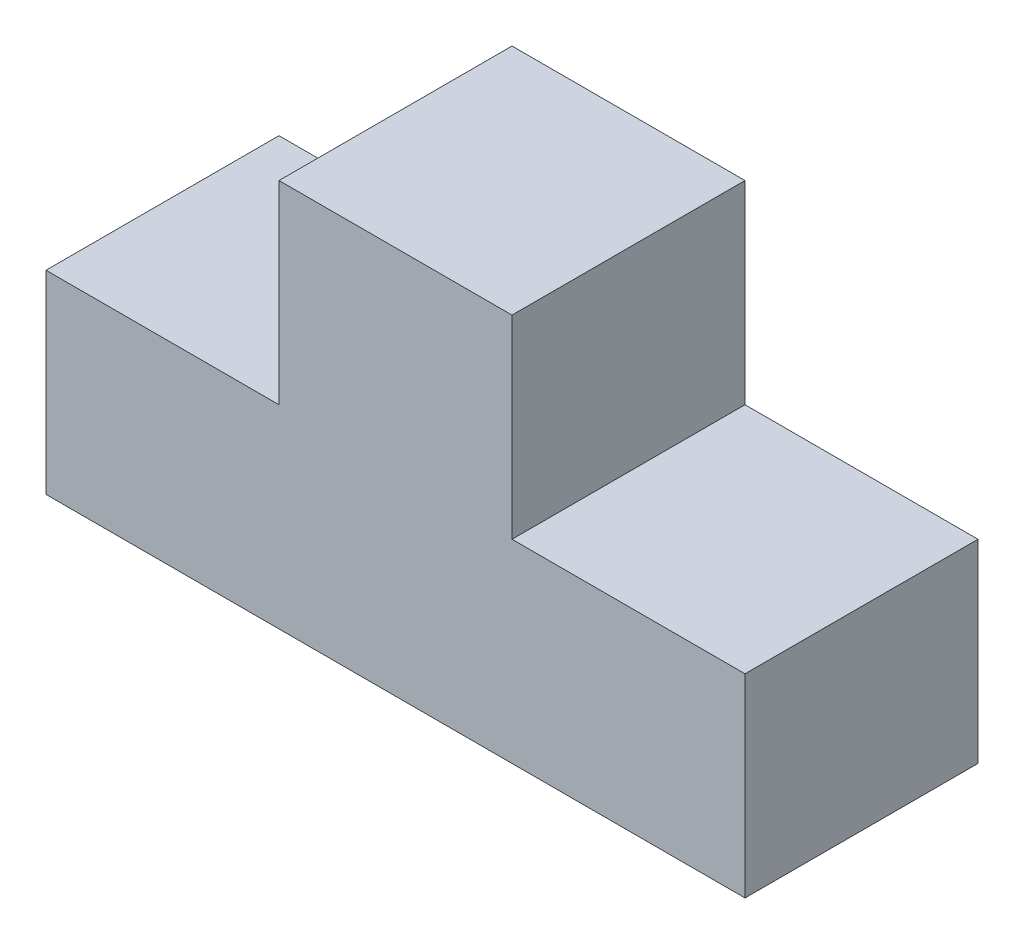
ISO-10303-21;
HEADER;
FILE_DESCRIPTION(('STEP AP214'),'2;1');
FILE_NAME('part.step','',(''),(''),'','','');
FILE_SCHEMA(('AUTOMOTIVE_DESIGN { 1 0 10303 214 1 1 1 1 }'));
ENDSEC;
DATA;
#1=APPLICATION_CONTEXT('core data for automotive mechanical design processes');
#2=APPLICATION_PROTOCOL_DEFINITION('international standard','automotive_design',2000,#1);
#3=PRODUCT_CONTEXT('',#1,'mechanical');
#4=PRODUCT('Part','Part','',(#3));
#5=PRODUCT_RELATED_PRODUCT_CATEGORY('part','',(#4));
#6=PRODUCT_DEFINITION_FORMATION('','',#4);
#7=PRODUCT_DEFINITION_CONTEXT('part definition',#1,'design');
#8=PRODUCT_DEFINITION('design','',#6,#7);
#9=PRODUCT_DEFINITION_SHAPE('','',#8);
#10=(LENGTH_UNIT() NAMED_UNIT(*) SI_UNIT(.MILLI.,.METRE.));
#11=(NAMED_UNIT(*) PLANE_ANGLE_UNIT() SI_UNIT($,.RADIAN.));
#12=(NAMED_UNIT(*) SI_UNIT($,.STERADIAN.) SOLID_ANGLE_UNIT());
#13=UNCERTAINTY_MEASURE_WITH_UNIT(LENGTH_MEASURE(1.E-05),#10,'distance_accuracy_value','');
#14=(GEOMETRIC_REPRESENTATION_CONTEXT(3) GLOBAL_UNCERTAINTY_ASSIGNED_CONTEXT((#13)) GLOBAL_UNIT_ASSIGNED_CONTEXT((#10,
#11,#12)) REPRESENTATION_CONTEXT('',''));
#15=CARTESIAN_POINT('',(0.,0.,0.));
#16=DIRECTION('',(0.,0.,1.));
#17=DIRECTION('',(1.,0.,0.));
#18=AXIS2_PLACEMENT_3D('',#15,#16,#17);
#19=CARTESIAN_POINT('',(45.,0.,30.));
#20=DIRECTION('',(-1.,0.,0.));
#21=DIRECTION('',(0.,-1.,0.));
#22=AXIS2_PLACEMENT_3D('',#19,#20,#21);
#23=PLANE('',#22);
#24=DIRECTION('',(0.,1.,0.));
#25=VECTOR('',#24,1.);
#26=CARTESIAN_POINT('',(45.,0.,0.));
#27=LINE('',#26,#25);
#28=CARTESIAN_POINT('',(45.,0.,0.));
#29=VERTEX_POINT('',#28);
#30=CARTESIAN_POINT('',(45.,25.,0.));
#31=VERTEX_POINT('',#30);
#32=EDGE_CURVE('E129',#29,#31,#27,.T.);
#33=ORIENTED_EDGE('',*,*,#32,.T.);
#34=DIRECTION('',(0.,0.,-1.));
#35=VECTOR('',#34,1.);
#36=CARTESIAN_POINT('',(45.,25.,30.));
#37=LINE('',#36,#35);
#38=CARTESIAN_POINT('',(45.,25.,30.));
#39=VERTEX_POINT('',#38);
#40=EDGE_CURVE('E11',#39,#31,#37,.T.);
#41=ORIENTED_EDGE('',*,*,#40,.F.);
#42=DIRECTION('',(0.,1.,0.));
#43=VECTOR('',#42,1.);
#44=CARTESIAN_POINT('',(45.,0.,30.));
#45=LINE('',#44,#43);
#46=CARTESIAN_POINT('',(45.,0.,30.));
#47=VERTEX_POINT('',#46);
#48=EDGE_CURVE('E143',#47,#39,#45,.T.);
#49=ORIENTED_EDGE('',*,*,#48,.F.);
#50=DIRECTION('',(0.,0.,-1.));
#51=VECTOR('',#50,1.);
#52=CARTESIAN_POINT('',(45.,0.,30.));
#53=LINE('',#52,#51);
#54=EDGE_CURVE('E125',#47,#29,#53,.T.);
#55=ORIENTED_EDGE('',*,*,#54,.T.);
#56=EDGE_LOOP('',(#33,#41,#49,#55));
#57=FACE_BOUND('',#56,.T.);
#58=ADVANCED_FACE('F33',(#57),#23,.F.);
#59=CARTESIAN_POINT('',(45.,25.,30.));
#60=DIRECTION('',(0.,-1.,0.));
#61=DIRECTION('',(0.,0.,-1.));
#62=AXIS2_PLACEMENT_3D('',#59,#60,#61);
#63=PLANE('',#62);
#64=DIRECTION('',(-1.,0.,0.));
#65=VECTOR('',#64,1.);
#66=CARTESIAN_POINT('',(45.,25.,0.));
#67=LINE('',#66,#65);
#68=CARTESIAN_POINT('',(15.,25.,0.));
#69=VERTEX_POINT('',#68);
#70=EDGE_CURVE('E132',#31,#69,#67,.T.);
#71=ORIENTED_EDGE('',*,*,#70,.T.);
#72=DIRECTION('',(0.,0.,-1.));
#73=VECTOR('',#72,1.);
#74=CARTESIAN_POINT('',(15.,25.,30.));
#75=LINE('',#74,#73);
#76=CARTESIAN_POINT('',(15.,25.,30.));
#77=VERTEX_POINT('',#76);
#78=EDGE_CURVE('E41',#77,#69,#75,.T.);
#79=ORIENTED_EDGE('',*,*,#78,.F.);
#80=DIRECTION('',(-1.,0.,0.));
#81=VECTOR('',#80,1.);
#82=CARTESIAN_POINT('',(45.,25.,30.));
#83=LINE('',#82,#81);
#84=EDGE_CURVE('E92',#39,#77,#83,.T.);
#85=ORIENTED_EDGE('',*,*,#84,.F.);
#86=ORIENTED_EDGE('',*,*,#40,.T.);
#87=EDGE_LOOP('',(#71,#79,#85,#86));
#88=FACE_BOUND('',#87,.T.);
#89=ADVANCED_FACE('F178',(#88),#63,.F.);
#90=CARTESIAN_POINT('',(15.,25.,30.));
#91=DIRECTION('',(-1.,0.,0.));
#92=DIRECTION('',(0.,0.,1.));
#93=AXIS2_PLACEMENT_3D('',#90,#91,#92);
#94=PLANE('',#93);
#95=DIRECTION('',(0.,1.,0.));
#96=VECTOR('',#95,1.);
#97=CARTESIAN_POINT('',(15.,25.,0.));
#98=LINE('',#97,#96);
#99=CARTESIAN_POINT('',(15.,50.,0.));
#100=VERTEX_POINT('',#99);
#101=EDGE_CURVE('E134',#69,#100,#98,.T.);
#102=ORIENTED_EDGE('',*,*,#101,.T.);
#103=DIRECTION('',(0.,0.,-1.));
#104=VECTOR('',#103,1.);
#105=CARTESIAN_POINT('',(15.,50.,30.));
#106=LINE('',#105,#104);
#107=CARTESIAN_POINT('',(15.,50.,30.));
#108=VERTEX_POINT('',#107);
#109=EDGE_CURVE('E150',#108,#100,#106,.T.);
#110=ORIENTED_EDGE('',*,*,#109,.F.);
#111=DIRECTION('',(0.,1.,0.));
#112=VECTOR('',#111,1.);
#113=CARTESIAN_POINT('',(15.,25.,30.));
#114=LINE('',#113,#112);
#115=EDGE_CURVE('E158',#77,#108,#114,.T.);
#116=ORIENTED_EDGE('',*,*,#115,.F.);
#117=ORIENTED_EDGE('',*,*,#78,.T.);
#118=EDGE_LOOP('',(#102,#110,#116,#117));
#119=FACE_BOUND('',#118,.T.);
#120=ADVANCED_FACE('F156',(#119),#94,.F.);
#121=CARTESIAN_POINT('',(15.,50.,30.));
#122=DIRECTION('',(0.,-1.,0.));
#123=DIRECTION('',(1.,0.,0.));
#124=AXIS2_PLACEMENT_3D('',#121,#122,#123);
#125=PLANE('',#124);
#126=DIRECTION('',(-1.,0.,0.));
#127=VECTOR('',#126,1.);
#128=CARTESIAN_POINT('',(15.,50.,0.));
#129=LINE('',#128,#127);
#130=CARTESIAN_POINT('',(-15.,50.,0.));
#131=VERTEX_POINT('',#130);
#132=EDGE_CURVE('E136',#100,#131,#129,.T.);
#133=ORIENTED_EDGE('',*,*,#132,.T.);
#134=DIRECTION('',(0.,0.,-1.));
#135=VECTOR('',#134,1.);
#136=CARTESIAN_POINT('',(-15.,50.,30.));
#137=LINE('',#136,#135);
#138=CARTESIAN_POINT('',(-15.,50.,30.));
#139=VERTEX_POINT('',#138);
#140=EDGE_CURVE('E147',#139,#131,#137,.T.);
#141=ORIENTED_EDGE('',*,*,#140,.F.);
#142=DIRECTION('',(-1.,0.,0.));
#143=VECTOR('',#142,1.);
#144=CARTESIAN_POINT('',(15.,50.,30.));
#145=LINE('',#144,#143);
#146=EDGE_CURVE('E170',#108,#139,#145,.T.);
#147=ORIENTED_EDGE('',*,*,#146,.F.);
#148=ORIENTED_EDGE('',*,*,#109,.T.);
#149=EDGE_LOOP('',(#133,#141,#147,#148));
#150=FACE_BOUND('',#149,.T.);
#151=ADVANCED_FACE('F166',(#150),#125,.F.);
#152=CARTESIAN_POINT('',(-15.,25.,30.));
#153=DIRECTION('',(1.,0.,0.));
#154=DIRECTION('',(0.,1.,0.));
#155=AXIS2_PLACEMENT_3D('',#152,#153,#154);
#156=PLANE('',#155);
#157=DIRECTION('',(0.,-1.,0.));
#158=VECTOR('',#157,1.);
#159=CARTESIAN_POINT('',(-15.,25.,0.));
#160=LINE('',#159,#158);
#161=CARTESIAN_POINT('',(-15.,25.,0.));
#162=VERTEX_POINT('',#161);
#163=EDGE_CURVE('E138',#131,#162,#160,.T.);
#164=ORIENTED_EDGE('',*,*,#163,.T.);
#165=DIRECTION('',(0.,0.,-1.));
#166=VECTOR('',#165,1.);
#167=CARTESIAN_POINT('',(-15.,25.,30.));
#168=LINE('',#167,#166);
#169=CARTESIAN_POINT('',(-15.,25.,30.));
#170=VERTEX_POINT('',#169);
#171=EDGE_CURVE('E120',#170,#162,#168,.T.);
#172=ORIENTED_EDGE('',*,*,#171,.F.);
#173=DIRECTION('',(0.,-1.,0.));
#174=VECTOR('',#173,1.);
#175=CARTESIAN_POINT('',(-15.,25.,30.));
#176=LINE('',#175,#174);
#177=EDGE_CURVE('E111',#139,#170,#176,.T.);
#178=ORIENTED_EDGE('',*,*,#177,.F.);
#179=ORIENTED_EDGE('',*,*,#140,.T.);
#180=EDGE_LOOP('',(#164,#172,#178,#179));
#181=FACE_BOUND('',#180,.T.);
#182=ADVANCED_FACE('F169',(#181),#156,.F.);
#183=CARTESIAN_POINT('',(-45.,25.,30.));
#184=DIRECTION('',(0.,-1.,0.));
#185=DIRECTION('',(1.,0.,0.));
#186=AXIS2_PLACEMENT_3D('',#183,#184,#185);
#187=PLANE('',#186);
#188=DIRECTION('',(-1.,0.,0.));
#189=VECTOR('',#188,1.);
#190=CARTESIAN_POINT('',(-45.,25.,0.));
#191=LINE('',#190,#189);
#192=CARTESIAN_POINT('',(-45.,25.,0.));
#193=VERTEX_POINT('',#192);
#194=EDGE_CURVE('E119',#162,#193,#191,.T.);
#195=ORIENTED_EDGE('',*,*,#194,.T.);
#196=DIRECTION('',(0.,0.,-1.));
#197=VECTOR('',#196,1.);
#198=CARTESIAN_POINT('',(-45.,25.,30.));
#199=LINE('',#198,#197);
#200=CARTESIAN_POINT('',(-45.,25.,30.));
#201=VERTEX_POINT('',#200);
#202=EDGE_CURVE('E116',#201,#193,#199,.T.);
#203=ORIENTED_EDGE('',*,*,#202,.F.);
#204=DIRECTION('',(-1.,0.,0.));
#205=VECTOR('',#204,1.);
#206=CARTESIAN_POINT('',(-45.,25.,30.));
#207=LINE('',#206,#205);
#208=EDGE_CURVE('E105',#170,#201,#207,.T.);
#209=ORIENTED_EDGE('',*,*,#208,.F.);
#210=ORIENTED_EDGE('',*,*,#171,.T.);
#211=EDGE_LOOP('',(#195,#203,#209,#210));
#212=FACE_BOUND('',#211,.T.);
#213=ADVANCED_FACE('F117',(#212),#187,.F.);
#214=CARTESIAN_POINT('',(-45.,0.,30.));
#215=DIRECTION('',(1.,0.,0.));
#216=DIRECTION('',(0.,1.,0.));
#217=AXIS2_PLACEMENT_3D('',#214,#215,#216);
#218=PLANE('',#217);
#219=DIRECTION('',(0.,-1.,0.));
#220=VECTOR('',#219,1.);
#221=CARTESIAN_POINT('',(-45.,0.,0.));
#222=LINE('',#221,#220);
#223=CARTESIAN_POINT('',(-45.,0.,0.));
#224=VERTEX_POINT('',#223);
#225=EDGE_CURVE('E78',#193,#224,#222,.T.);
#226=ORIENTED_EDGE('',*,*,#225,.T.);
#227=DIRECTION('',(0.,0.,-1.));
#228=VECTOR('',#227,1.);
#229=CARTESIAN_POINT('',(-45.,0.,30.));
#230=LINE('',#229,#228);
#231=CARTESIAN_POINT('',(-45.,0.,30.));
#232=VERTEX_POINT('',#231);
#233=EDGE_CURVE('E121',#232,#224,#230,.T.);
#234=ORIENTED_EDGE('',*,*,#233,.F.);
#235=DIRECTION('',(0.,-1.,0.));
#236=VECTOR('',#235,1.);
#237=CARTESIAN_POINT('',(-45.,0.,30.));
#238=LINE('',#237,#236);
#239=EDGE_CURVE('E109',#201,#232,#238,.T.);
#240=ORIENTED_EDGE('',*,*,#239,.F.);
#241=ORIENTED_EDGE('',*,*,#202,.T.);
#242=EDGE_LOOP('',(#226,#234,#240,#241));
#243=FACE_BOUND('',#242,.T.);
#244=ADVANCED_FACE('F123',(#243),#218,.F.);
#245=CARTESIAN_POINT('',(-45.,0.,30.));
#246=DIRECTION('',(0.,1.,0.));
#247=DIRECTION('',(-1.,0.,0.));
#248=AXIS2_PLACEMENT_3D('',#245,#246,#247);
#249=PLANE('',#248);
#250=DIRECTION('',(1.,0.,0.));
#251=VECTOR('',#250,1.);
#252=CARTESIAN_POINT('',(-45.,0.,0.));
#253=LINE('',#252,#251);
#254=EDGE_CURVE('E84',#224,#29,#253,.T.);
#255=ORIENTED_EDGE('',*,*,#254,.T.);
#256=ORIENTED_EDGE('',*,*,#54,.F.);
#257=DIRECTION('',(1.,0.,0.));
#258=VECTOR('',#257,1.);
#259=CARTESIAN_POINT('',(-45.,0.,30.));
#260=LINE('',#259,#258);
#261=EDGE_CURVE('E49',#232,#47,#260,.T.);
#262=ORIENTED_EDGE('',*,*,#261,.F.);
#263=ORIENTED_EDGE('',*,*,#233,.T.);
#264=EDGE_LOOP('',(#255,#256,#262,#263));
#265=FACE_BOUND('',#264,.T.);
#266=ADVANCED_FACE('F194',(#265),#249,.F.);
#267=CARTESIAN_POINT('',(0.,0.,30.));
#268=DIRECTION('',(0.,0.,1.));
#269=DIRECTION('',(1.,0.,0.));
#270=AXIS2_PLACEMENT_3D('',#267,#268,#269);
#271=PLANE('',#270);
#272=ORIENTED_EDGE('',*,*,#48,.T.);
#273=ORIENTED_EDGE('',*,*,#84,.T.);
#274=ORIENTED_EDGE('',*,*,#115,.T.);
#275=ORIENTED_EDGE('',*,*,#146,.T.);
#276=ORIENTED_EDGE('',*,*,#177,.T.);
#277=ORIENTED_EDGE('',*,*,#208,.T.);
#278=ORIENTED_EDGE('',*,*,#239,.T.);
#279=ORIENTED_EDGE('',*,*,#261,.T.);
#280=EDGE_LOOP('',(#272,#273,#274,#275,#276,#277,#278,#279));
#281=FACE_BOUND('',#280,.T.);
#282=ADVANCED_FACE('F107',(#281),#271,.T.);
#283=CARTESIAN_POINT('',(0.,0.,0.));
#284=DIRECTION('',(0.,0.,1.));
#285=DIRECTION('',(1.,0.,0.));
#286=AXIS2_PLACEMENT_3D('',#283,#284,#285);
#287=PLANE('',#286);
#288=ORIENTED_EDGE('',*,*,#32,.F.);
#289=ORIENTED_EDGE('',*,*,#254,.F.);
#290=ORIENTED_EDGE('',*,*,#225,.F.);
#291=ORIENTED_EDGE('',*,*,#194,.F.);
#292=ORIENTED_EDGE('',*,*,#163,.F.);
#293=ORIENTED_EDGE('',*,*,#132,.F.);
#294=ORIENTED_EDGE('',*,*,#101,.F.);
#295=ORIENTED_EDGE('',*,*,#70,.F.);
#296=EDGE_LOOP('',(#288,#289,#290,#291,#292,#293,#294,#295));
#297=FACE_BOUND('',#296,.T.);
#298=ADVANCED_FACE('F162',(#297),#287,.F.);
#299=CLOSED_SHELL('',(#58,#89,#120,#151,#182,#213,#244,#266,#282,#298));
#300=MANIFOLD_SOLID_BREP('B2',#299);
#301=ADVANCED_BREP_SHAPE_REPRESENTATION('',(#18,#300),#14);
#302=SHAPE_DEFINITION_REPRESENTATION(#9,#301);
ENDSEC;
END-ISO-10303-21;
